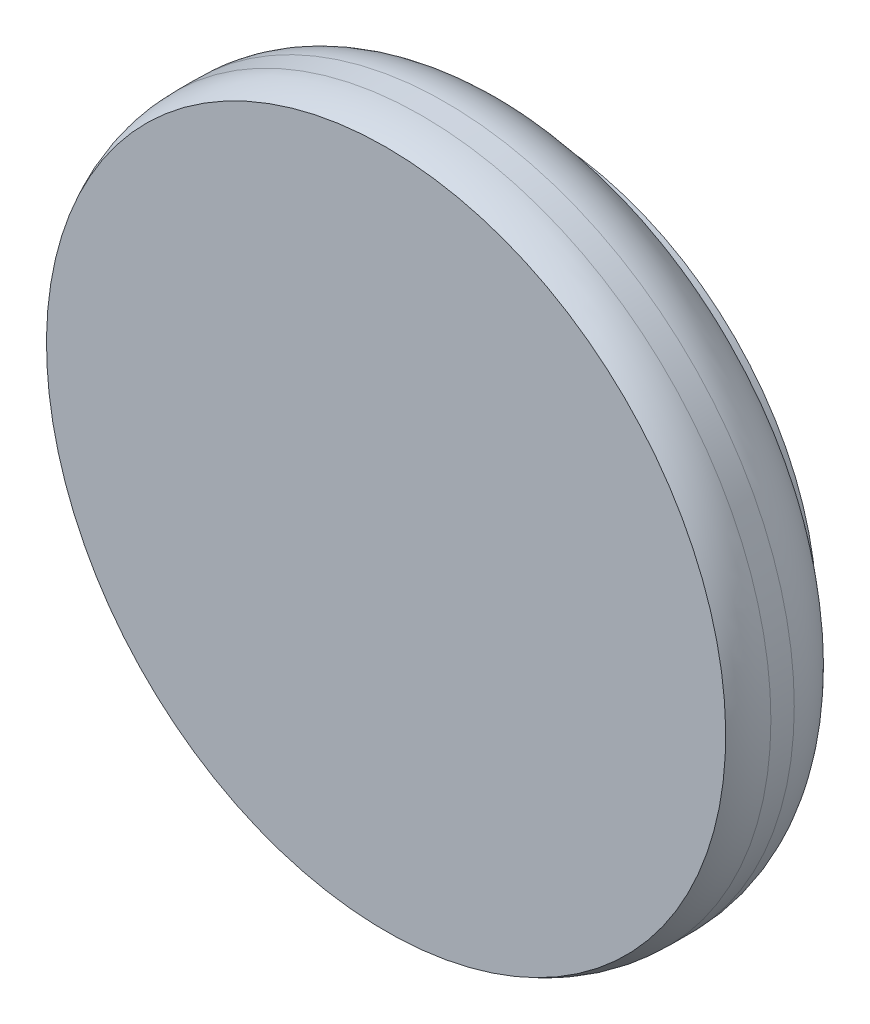
ISO-10303-21;
HEADER;
FILE_DESCRIPTION(('STEP AP214'),'2;1');
FILE_NAME('part.step','',(''),(''),'','','');
FILE_SCHEMA(('AUTOMOTIVE_DESIGN { 1 0 10303 214 1 1 1 1 }'));
ENDSEC;
DATA;
#1=APPLICATION_CONTEXT('core data for automotive mechanical design processes');
#2=APPLICATION_PROTOCOL_DEFINITION('international standard','automotive_design',2000,#1);
#3=PRODUCT_CONTEXT('',#1,'mechanical');
#4=PRODUCT('Part','Part','',(#3));
#5=PRODUCT_RELATED_PRODUCT_CATEGORY('part','',(#4));
#6=PRODUCT_DEFINITION_FORMATION('','',#4);
#7=PRODUCT_DEFINITION_CONTEXT('part definition',#1,'design');
#8=PRODUCT_DEFINITION('design','',#6,#7);
#9=PRODUCT_DEFINITION_SHAPE('','',#8);
#10=(LENGTH_UNIT() NAMED_UNIT(*) SI_UNIT(.MILLI.,.METRE.));
#11=(NAMED_UNIT(*) PLANE_ANGLE_UNIT() SI_UNIT($,.RADIAN.));
#12=(NAMED_UNIT(*) SI_UNIT($,.STERADIAN.) SOLID_ANGLE_UNIT());
#13=UNCERTAINTY_MEASURE_WITH_UNIT(LENGTH_MEASURE(1.E-05),#10,'distance_accuracy_value','');
#14=(GEOMETRIC_REPRESENTATION_CONTEXT(3) GLOBAL_UNCERTAINTY_ASSIGNED_CONTEXT((#13)) GLOBAL_UNIT_ASSIGNED_CONTEXT((#10,
#11,#12)) REPRESENTATION_CONTEXT('',''));
#15=CARTESIAN_POINT('',(0.,0.,0.));
#16=DIRECTION('',(0.,0.,1.));
#17=DIRECTION('',(1.,0.,0.));
#18=AXIS2_PLACEMENT_3D('',#15,#16,#17);
#19=CARTESIAN_POINT('',(-74.668194168406,-39.6644186635385,-3.49999999999999));
#20=DIRECTION('',(0.,0.,-1.));
#21=DIRECTION('',(-1.,0.,0.));
#22=AXIS2_PLACEMENT_3D('',#19,#20,#21);
#23=PLANE('',#22);
#24=CARTESIAN_POINT('',(-75.418194168406,-39.6644186635387,-3.49999999999999));
#25=DIRECTION('',(0.,0.,1.));
#26=DIRECTION('',(1.,0.,0.));
#27=AXIS2_PLACEMENT_3D('',#24,#25,#26);
#28=CIRCLE('',#27,1.50000000000003);
#29=CARTESIAN_POINT('',(-73.918194168406,-39.6644186635387,-3.49999999999999));
#30=VERTEX_POINT('',#29);
#31=EDGE_CURVE('E19',#30,#30,#28,.T.);
#32=ORIENTED_EDGE('',*,*,#31,.F.);
#33=EDGE_LOOP('',(#32));
#34=FACE_BOUND('',#33,.T.);
#35=ADVANCED_FACE('F15',(#34),#23,.T.);
#36=CARTESIAN_POINT('',(-75.418194168406,-39.6644186635387,-3.49999999999999));
#37=DIRECTION('',(0.,0.,1.));
#38=DIRECTION('',(1.,0.,0.));
#39=AXIS2_PLACEMENT_3D('',#36,#37,#38);
#40=CYLINDRICAL_SURFACE('',#39,1.50000000000003);
#41=CARTESIAN_POINT('',(-75.418194168406,-39.6644186635387,-3.37999999999998));
#42=DIRECTION('',(0.,0.,1.));
#43=DIRECTION('',(0.,-1.,0.));
#44=AXIS2_PLACEMENT_3D('',#41,#42,#43);
#45=CIRCLE('',#44,1.5);
#46=CARTESIAN_POINT('',(-75.418194168406,-41.1644186635387,-3.37999999999998));
#47=VERTEX_POINT('',#46);
#48=EDGE_CURVE('E30',#47,#47,#45,.T.);
#49=ORIENTED_EDGE('',*,*,#48,.F.);
#50=EDGE_LOOP('',(#49));
#51=FACE_BOUND('',#50,.T.);
#52=ORIENTED_EDGE('',*,*,#31,.T.);
#53=EDGE_LOOP('',(#52));
#54=FACE_BOUND('',#53,.T.);
#55=ADVANCED_FACE('F41',(#51,#54),#40,.T.);
#56=CARTESIAN_POINT('',(-75.418194168406,-39.6644186635387,-2.99999999999998));
#57=DIRECTION('',(0.,0.,-1.));
#58=DIRECTION('',(0.,1.,0.));
#59=AXIS2_PLACEMENT_3D('',#56,#57,#58);
#60=TOROIDAL_SURFACE('',#59,1.50000000000003,0.38);
#61=CARTESIAN_POINT('',(-75.418194168406,-39.6644186635387,-2.99999999999998));
#62=DIRECTION('',(0.,0.,1.));
#63=DIRECTION('',(1.,0.,0.));
#64=AXIS2_PLACEMENT_3D('',#61,#62,#63);
#65=CIRCLE('',#64,1.88000000000003);
#66=CARTESIAN_POINT('',(-73.538194168406,-39.6644186635387,-2.99999999999998));
#67=VERTEX_POINT('',#66);
#68=EDGE_CURVE('E27',#67,#67,#65,.T.);
#69=ORIENTED_EDGE('',*,*,#68,.F.);
#70=EDGE_LOOP('',(#69));
#71=FACE_BOUND('',#70,.T.);
#72=ORIENTED_EDGE('',*,*,#48,.T.);
#73=EDGE_LOOP('',(#72));
#74=FACE_BOUND('',#73,.T.);
#75=ADVANCED_FACE('F38',(#71,#74),#60,.T.);
#76=CARTESIAN_POINT('',(-75.418194168406,-39.6644186635387,-2.8599811276401));
#77=DIRECTION('',(0.,0.,1.));
#78=DIRECTION('',(1.,0.,0.));
#79=AXIS2_PLACEMENT_3D('',#76,#77,#78);
#80=CYLINDRICAL_SURFACE('',#79,1.88000000000003);
#81=CARTESIAN_POINT('',(-75.418194168406,-39.6644186635387,-2.87401109456516));
#82=DIRECTION('',(0.,0.,1.));
#83=DIRECTION('',(1.,0.,0.));
#84=AXIS2_PLACEMENT_3D('',#81,#82,#83);
#85=CIRCLE('',#84,1.88000000000003);
#86=CARTESIAN_POINT('',(-73.538194168406,-39.6644186635387,-2.87401109456516));
#87=VERTEX_POINT('',#86);
#88=EDGE_CURVE('E23',#87,#87,#85,.T.);
#89=ORIENTED_EDGE('',*,*,#88,.F.);
#90=EDGE_LOOP('',(#89));
#91=FACE_BOUND('',#90,.T.);
#92=ORIENTED_EDGE('',*,*,#68,.T.);
#93=EDGE_LOOP('',(#92));
#94=FACE_BOUND('',#93,.T.);
#95=ADVANCED_FACE('F36',(#91,#94),#80,.T.);
#96=CARTESIAN_POINT('',(-75.418194168406,-39.6644186635387,-2.87401109456516));
#97=DIRECTION('',(0.,0.,-1.));
#98=DIRECTION('',(-1.,0.,0.));
#99=AXIS2_PLACEMENT_3D('',#96,#97,#98);
#100=TOROIDAL_SURFACE('',#99,1.47999999999993,0.400000000000103);
#101=ORIENTED_EDGE('',*,*,#88,.T.);
#102=EDGE_LOOP('',(#101));
#103=FACE_BOUND('',#102,.T.);
#104=CARTESIAN_POINT('',(-75.418194168406,-39.6644186635387,-2.6804035068493));
#105=DIRECTION('',(0.,0.,-1.));
#106=DIRECTION('',(0.,1.,0.));
#107=AXIS2_PLACEMENT_3D('',#104,#105,#106);
#108=CIRCLE('',#107,1.83002300207109);
#109=CARTESIAN_POINT('',(-75.418194168406,-37.8343956614676,-2.6804035068493));
#110=VERTEX_POINT('',#109);
#111=EDGE_CURVE('E10',#110,#110,#108,.T.);
#112=ORIENTED_EDGE('',*,*,#111,.T.);
#113=EDGE_LOOP('',(#112));
#114=FACE_BOUND('',#113,.T.);
#115=ADVANCED_FACE('F17',(#103,#114),#100,.T.);
#116=CARTESIAN_POINT('',(-75.418194168406,-39.6644186635387,-2.6804035068493));
#117=DIRECTION('',(0.,0.,-1.));
#118=DIRECTION('',(-1.,0.,0.));
#119=AXIS2_PLACEMENT_3D('',#116,#117,#118);
#120=PLANE('',#119);
#121=ORIENTED_EDGE('',*,*,#111,.F.);
#122=EDGE_LOOP('',(#121));
#123=FACE_BOUND('',#122,.T.);
#124=ADVANCED_FACE('F55',(#123),#120,.F.);
#125=CLOSED_SHELL('',(#35,#55,#75,#95,#115,#124));
#126=MANIFOLD_SOLID_BREP('B1',#125);
#127=ADVANCED_BREP_SHAPE_REPRESENTATION('',(#18,#126),#14);
#128=SHAPE_DEFINITION_REPRESENTATION(#9,#127);
ENDSEC;
END-ISO-10303-21;
